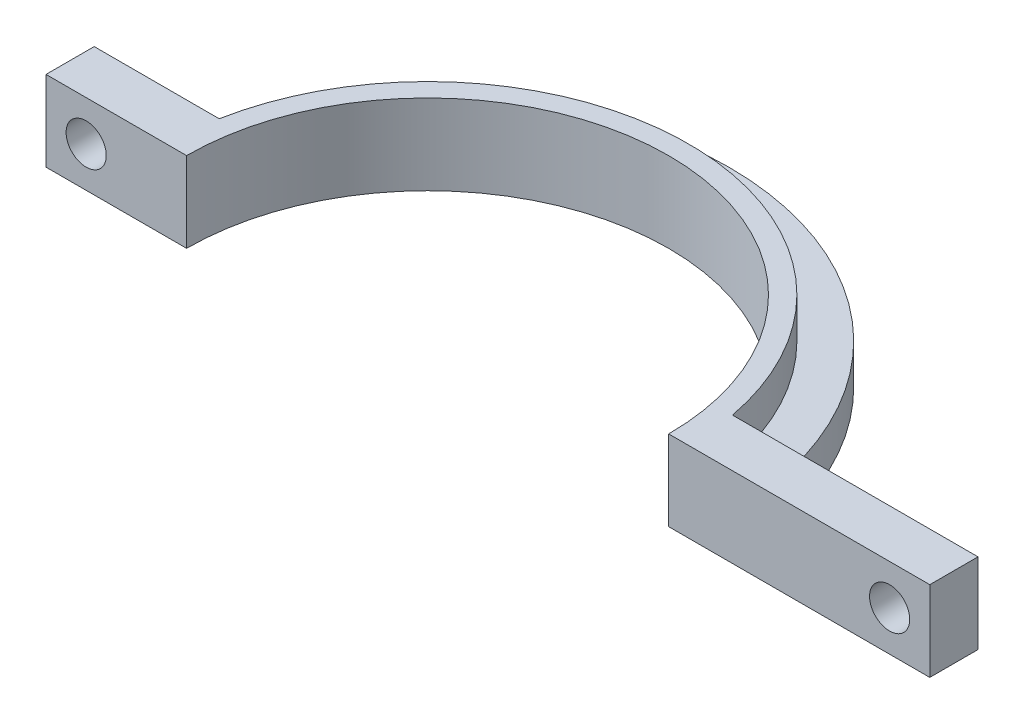
ISO-10303-21;
HEADER;
FILE_DESCRIPTION(('STEP AP214'),'2;1');
FILE_NAME('part.step','',(''),(''),'','','');
FILE_SCHEMA(('AUTOMOTIVE_DESIGN { 1 0 10303 214 1 1 1 1 }'));
ENDSEC;
DATA;
#1=APPLICATION_CONTEXT('core data for automotive mechanical design processes');
#2=APPLICATION_PROTOCOL_DEFINITION('international standard','automotive_design',2000,#1);
#3=PRODUCT_CONTEXT('',#1,'mechanical');
#4=PRODUCT('Part','Part','',(#3));
#5=PRODUCT_RELATED_PRODUCT_CATEGORY('part','',(#4));
#6=PRODUCT_DEFINITION_FORMATION('','',#4);
#7=PRODUCT_DEFINITION_CONTEXT('part definition',#1,'design');
#8=PRODUCT_DEFINITION('design','',#6,#7);
#9=PRODUCT_DEFINITION_SHAPE('','',#8);
#10=(LENGTH_UNIT() NAMED_UNIT(*) SI_UNIT(.MILLI.,.METRE.));
#11=(NAMED_UNIT(*) PLANE_ANGLE_UNIT() SI_UNIT($,.RADIAN.));
#12=(NAMED_UNIT(*) SI_UNIT($,.STERADIAN.) SOLID_ANGLE_UNIT());
#13=UNCERTAINTY_MEASURE_WITH_UNIT(LENGTH_MEASURE(1.E-05),#10,'distance_accuracy_value','');
#14=(GEOMETRIC_REPRESENTATION_CONTEXT(3) GLOBAL_UNCERTAINTY_ASSIGNED_CONTEXT((#13)) GLOBAL_UNIT_ASSIGNED_CONTEXT((#10,
#11,#12)) REPRESENTATION_CONTEXT('',''));
#15=CARTESIAN_POINT('',(0.,0.,0.));
#16=DIRECTION('',(0.,0.,1.));
#17=DIRECTION('',(1.,0.,0.));
#18=AXIS2_PLACEMENT_3D('',#15,#16,#17);
#19=CARTESIAN_POINT('',(0.,10.,-6.));
#20=DIRECTION('',(0.,0.,1.));
#21=DIRECTION('',(1.,0.,0.));
#22=AXIS2_PLACEMENT_3D('',#19,#20,#21);
#23=PLANE('',#22);
#24=CARTESIAN_POINT('',(57.5,5.,-6.00000000000001));
#25=DIRECTION('',(0.,0.,1.));
#26=DIRECTION('',(1.,0.,0.));
#27=AXIS2_PLACEMENT_3D('',#24,#25,#26);
#28=CIRCLE('',#27,2.50000000000001);
#29=CARTESIAN_POINT('',(60.,5.,-6.00000000000001));
#30=VERTEX_POINT('',#29);
#31=EDGE_CURVE('E51',#30,#30,#28,.T.);
#32=ORIENTED_EDGE('',*,*,#31,.T.);
#33=EDGE_LOOP('',(#32));
#34=FACE_BOUND('',#33,.T.);
#35=DIRECTION('',(0.,-1.,0.));
#36=VECTOR('',#35,1.);
#37=CARTESIAN_POINT('',(37.0168880377592,5.,-6.00000000000001));
#38=LINE('',#37,#36);
#39=CARTESIAN_POINT('',(37.0168880377592,5.,-6.00000000000001));
#40=VERTEX_POINT('',#39);
#41=CARTESIAN_POINT('',(37.0168880377592,0.,-6.00000000000001));
#42=VERTEX_POINT('',#41);
#43=EDGE_CURVE('E64',#40,#42,#38,.T.);
#44=ORIENTED_EDGE('',*,*,#43,.F.);
#45=DIRECTION('',(-1.,0.,0.));
#46=VECTOR('',#45,1.);
#47=CARTESIAN_POINT('',(0.,5.,-6.));
#48=LINE('',#47,#46);
#49=CARTESIAN_POINT('',(31.9413525073689,5.,-6.));
#50=VERTEX_POINT('',#49);
#51=EDGE_CURVE('E68',#40,#50,#48,.T.);
#52=ORIENTED_EDGE('',*,*,#51,.T.);
#53=DIRECTION('',(0.,-1.,0.));
#54=VECTOR('',#53,1.);
#55=CARTESIAN_POINT('',(31.9413525073689,10.,-6.));
#56=LINE('',#55,#54);
#57=CARTESIAN_POINT('',(31.9413525073689,10.,-6.));
#58=VERTEX_POINT('',#57);
#59=EDGE_CURVE('E194',#58,#50,#56,.T.);
#60=ORIENTED_EDGE('',*,*,#59,.F.);
#61=DIRECTION('',(-1.,0.,0.));
#62=VECTOR('',#61,1.);
#63=CARTESIAN_POINT('',(0.,10.,-6.));
#64=LINE('',#63,#62);
#65=CARTESIAN_POINT('',(62.5,10.,-6.00000000000001));
#66=VERTEX_POINT('',#65);
#67=EDGE_CURVE('E132',#66,#58,#64,.T.);
#68=ORIENTED_EDGE('',*,*,#67,.F.);
#69=DIRECTION('',(0.,-1.,0.));
#70=VECTOR('',#69,1.);
#71=CARTESIAN_POINT('',(62.5,10.,-6.00000000000001));
#72=LINE('',#71,#70);
#73=CARTESIAN_POINT('',(62.5,0.,-6.00000000000001));
#74=VERTEX_POINT('',#73);
#75=EDGE_CURVE('E57',#66,#74,#72,.T.);
#76=ORIENTED_EDGE('',*,*,#75,.T.);
#77=DIRECTION('',(-1.,0.,0.));
#78=VECTOR('',#77,1.);
#79=CARTESIAN_POINT('',(0.,0.,-6.));
#80=LINE('',#79,#78);
#81=EDGE_CURVE('E158',#74,#42,#80,.T.);
#82=ORIENTED_EDGE('',*,*,#81,.T.);
#83=EDGE_LOOP('',(#44,#52,#60,#68,#76,#82));
#84=FACE_BOUND('',#83,.T.);
#85=ADVANCED_FACE('F47',(#34,#84),#23,.F.);
#86=CARTESIAN_POINT('',(0.,10.,-6.));
#87=DIRECTION('',(0.,0.,-1.));
#88=DIRECTION('',(-1.,0.,0.));
#89=AXIS2_PLACEMENT_3D('',#86,#87,#88);
#90=PLANE('',#89);
#91=CARTESIAN_POINT('',(-42.5,4.99999999999999,-6.));
#92=DIRECTION('',(0.,0.,-1.));
#93=DIRECTION('',(-1.,0.,0.));
#94=AXIS2_PLACEMENT_3D('',#91,#92,#93);
#95=CIRCLE('',#94,2.50000000000001);
#96=CARTESIAN_POINT('',(-45.,4.99999999999999,-6.));
#97=VERTEX_POINT('',#96);
#98=EDGE_CURVE('E262',#97,#97,#95,.T.);
#99=ORIENTED_EDGE('',*,*,#98,.F.);
#100=EDGE_LOOP('',(#99));
#101=FACE_BOUND('',#100,.T.);
#102=DIRECTION('',(1.,0.,0.));
#103=VECTOR('',#102,1.);
#104=CARTESIAN_POINT('',(0.,5.,-6.));
#105=LINE('',#104,#103);
#106=CARTESIAN_POINT('',(-37.0168880377592,5.,-6.));
#107=VERTEX_POINT('',#106);
#108=CARTESIAN_POINT('',(-31.9413525073689,5.,-6.));
#109=VERTEX_POINT('',#108);
#110=EDGE_CURVE('E251',#107,#109,#105,.T.);
#111=ORIENTED_EDGE('',*,*,#110,.F.);
#112=DIRECTION('',(0.,-1.,0.));
#113=VECTOR('',#112,1.);
#114=CARTESIAN_POINT('',(-37.0168880377592,5.,-6.));
#115=LINE('',#114,#113);
#116=CARTESIAN_POINT('',(-37.0168880377592,0.,-6.));
#117=VERTEX_POINT('',#116);
#118=EDGE_CURVE('E232',#107,#117,#115,.T.);
#119=ORIENTED_EDGE('',*,*,#118,.T.);
#120=DIRECTION('',(1.,0.,0.));
#121=VECTOR('',#120,1.);
#122=CARTESIAN_POINT('',(0.,0.,-6.));
#123=LINE('',#122,#121);
#124=CARTESIAN_POINT('',(-47.5,0.,-6.00000000000001));
#125=VERTEX_POINT('',#124);
#126=EDGE_CURVE('E162',#125,#117,#123,.T.);
#127=ORIENTED_EDGE('',*,*,#126,.F.);
#128=DIRECTION('',(0.,-1.,0.));
#129=VECTOR('',#128,1.);
#130=CARTESIAN_POINT('',(-47.5,10.,-6.00000000000001));
#131=LINE('',#130,#129);
#132=CARTESIAN_POINT('',(-47.5,10.,-6.00000000000001));
#133=VERTEX_POINT('',#132);
#134=EDGE_CURVE('E187',#133,#125,#131,.T.);
#135=ORIENTED_EDGE('',*,*,#134,.F.);
#136=DIRECTION('',(1.,0.,0.));
#137=VECTOR('',#136,1.);
#138=CARTESIAN_POINT('',(0.,10.,-6.));
#139=LINE('',#138,#137);
#140=CARTESIAN_POINT('',(-31.9413525073689,10.,-6.));
#141=VERTEX_POINT('',#140);
#142=EDGE_CURVE('E203',#133,#141,#139,.T.);
#143=ORIENTED_EDGE('',*,*,#142,.T.);
#144=DIRECTION('',(0.,-1.,0.));
#145=VECTOR('',#144,1.);
#146=CARTESIAN_POINT('',(-31.9413525073689,10.,-6.));
#147=LINE('',#146,#145);
#148=EDGE_CURVE('E190',#141,#109,#147,.T.);
#149=ORIENTED_EDGE('',*,*,#148,.T.);
#150=EDGE_LOOP('',(#111,#119,#127,#135,#143,#149));
#151=FACE_BOUND('',#150,.T.);
#152=ADVANCED_FACE('F230',(#101,#151),#90,.T.);
#153=CARTESIAN_POINT('',(0.,10.,0.));
#154=DIRECTION('',(0.,0.,-1.));
#155=DIRECTION('',(-1.,0.,0.));
#156=AXIS2_PLACEMENT_3D('',#153,#154,#155);
#157=PLANE('',#156);
#158=CARTESIAN_POINT('',(57.5,5.,0.));
#159=DIRECTION('',(0.,0.,1.));
#160=DIRECTION('',(1.,0.,0.));
#161=AXIS2_PLACEMENT_3D('',#158,#159,#160);
#162=CIRCLE('',#161,2.50000000000001);
#163=CARTESIAN_POINT('',(60.,5.,0.));
#164=VERTEX_POINT('',#163);
#165=EDGE_CURVE('E257',#164,#164,#162,.T.);
#166=ORIENTED_EDGE('',*,*,#165,.F.);
#167=EDGE_LOOP('',(#166));
#168=FACE_BOUND('',#167,.T.);
#169=DIRECTION('',(1.,0.,0.));
#170=VECTOR('',#169,1.);
#171=CARTESIAN_POINT('',(0.,0.,0.));
#172=LINE('',#171,#170);
#173=CARTESIAN_POINT('',(30.,0.,0.));
#174=VERTEX_POINT('',#173);
#175=CARTESIAN_POINT('',(62.5,0.,0.));
#176=VERTEX_POINT('',#175);
#177=EDGE_CURVE('E146',#174,#176,#172,.T.);
#178=ORIENTED_EDGE('',*,*,#177,.T.);
#179=DIRECTION('',(0.,-1.,0.));
#180=VECTOR('',#179,1.);
#181=CARTESIAN_POINT('',(62.5,10.,0.));
#182=LINE('',#181,#180);
#183=CARTESIAN_POINT('',(62.5,10.,0.));
#184=VERTEX_POINT('',#183);
#185=EDGE_CURVE('E11',#184,#176,#182,.T.);
#186=ORIENTED_EDGE('',*,*,#185,.F.);
#187=DIRECTION('',(1.,0.,0.));
#188=VECTOR('',#187,1.);
#189=CARTESIAN_POINT('',(0.,10.,0.));
#190=LINE('',#189,#188);
#191=CARTESIAN_POINT('',(30.,10.,0.));
#192=VERTEX_POINT('',#191);
#193=EDGE_CURVE('E133',#192,#184,#190,.T.);
#194=ORIENTED_EDGE('',*,*,#193,.F.);
#195=DIRECTION('',(0.,-1.,0.));
#196=VECTOR('',#195,1.);
#197=CARTESIAN_POINT('',(30.,10.,0.));
#198=LINE('',#197,#196);
#199=EDGE_CURVE('E148',#192,#174,#198,.T.);
#200=ORIENTED_EDGE('',*,*,#199,.T.);
#201=EDGE_LOOP('',(#178,#186,#194,#200));
#202=FACE_BOUND('',#201,.T.);
#203=ADVANCED_FACE('F49',(#168,#202),#157,.F.);
#204=CARTESIAN_POINT('',(62.5,10.,0.));
#205=DIRECTION('',(-1.,0.,0.));
#206=DIRECTION('',(0.,0.,1.));
#207=AXIS2_PLACEMENT_3D('',#204,#205,#206);
#208=PLANE('',#207);
#209=DIRECTION('',(0.,0.,-1.));
#210=VECTOR('',#209,1.);
#211=CARTESIAN_POINT('',(62.5,0.,0.));
#212=LINE('',#211,#210);
#213=EDGE_CURVE('E153',#176,#74,#212,.T.);
#214=ORIENTED_EDGE('',*,*,#213,.T.);
#215=ORIENTED_EDGE('',*,*,#75,.F.);
#216=DIRECTION('',(0.,0.,-1.));
#217=VECTOR('',#216,1.);
#218=CARTESIAN_POINT('',(62.5,10.,0.));
#219=LINE('',#218,#217);
#220=EDGE_CURVE('E124',#184,#66,#219,.T.);
#221=ORIENTED_EDGE('',*,*,#220,.F.);
#222=ORIENTED_EDGE('',*,*,#185,.T.);
#223=EDGE_LOOP('',(#214,#215,#221,#222));
#224=FACE_BOUND('',#223,.T.);
#225=ADVANCED_FACE('F126',(#224),#208,.F.);
#226=CARTESIAN_POINT('',(0.,10.,0.));
#227=DIRECTION('',(0.,-1.,0.));
#228=DIRECTION('',(0.,0.,-1.));
#229=AXIS2_PLACEMENT_3D('',#226,#227,#228);
#230=CYLINDRICAL_SURFACE('',#229,32.5);
#231=ORIENTED_EDGE('',*,*,#59,.T.);
#232=CARTESIAN_POINT('',(0.,5.,0.));
#233=DIRECTION('',(0.,1.,0.));
#234=DIRECTION('',(0.,0.,1.));
#235=AXIS2_PLACEMENT_3D('',#232,#233,#234);
#236=CIRCLE('',#235,32.5);
#237=EDGE_CURVE('E240',#50,#109,#236,.T.);
#238=ORIENTED_EDGE('',*,*,#237,.T.);
#239=ORIENTED_EDGE('',*,*,#148,.F.);
#240=CARTESIAN_POINT('',(0.,10.,0.));
#241=DIRECTION('',(0.,1.,0.));
#242=DIRECTION('',(0.,0.,1.));
#243=AXIS2_PLACEMENT_3D('',#240,#241,#242);
#244=CIRCLE('',#243,32.5);
#245=EDGE_CURVE('E200',#58,#141,#244,.T.);
#246=ORIENTED_EDGE('',*,*,#245,.F.);
#247=EDGE_LOOP('',(#231,#238,#239,#246));
#248=FACE_BOUND('',#247,.T.);
#249=ADVANCED_FACE('F297',(#248),#230,.T.);
#250=CARTESIAN_POINT('',(-47.5,10.,0.));
#251=DIRECTION('',(1.,0.,0.));
#252=DIRECTION('',(0.,0.,-1.));
#253=AXIS2_PLACEMENT_3D('',#250,#251,#252);
#254=PLANE('',#253);
#255=DIRECTION('',(0.,0.,1.));
#256=VECTOR('',#255,1.);
#257=CARTESIAN_POINT('',(-47.5,0.,0.));
#258=LINE('',#257,#256);
#259=CARTESIAN_POINT('',(-47.5,0.,0.));
#260=VERTEX_POINT('',#259);
#261=EDGE_CURVE('E169',#125,#260,#258,.T.);
#262=ORIENTED_EDGE('',*,*,#261,.T.);
#263=DIRECTION('',(0.,-1.,0.));
#264=VECTOR('',#263,1.);
#265=CARTESIAN_POINT('',(-47.5,10.,0.));
#266=LINE('',#265,#264);
#267=CARTESIAN_POINT('',(-47.5,10.,0.));
#268=VERTEX_POINT('',#267);
#269=EDGE_CURVE('E183',#268,#260,#266,.T.);
#270=ORIENTED_EDGE('',*,*,#269,.F.);
#271=DIRECTION('',(0.,0.,1.));
#272=VECTOR('',#271,1.);
#273=CARTESIAN_POINT('',(-47.5,10.,0.));
#274=LINE('',#273,#272);
#275=EDGE_CURVE('E209',#133,#268,#274,.T.);
#276=ORIENTED_EDGE('',*,*,#275,.F.);
#277=ORIENTED_EDGE('',*,*,#134,.T.);
#278=EDGE_LOOP('',(#262,#270,#276,#277));
#279=FACE_BOUND('',#278,.T.);
#280=ADVANCED_FACE('F227',(#279),#254,.F.);
#281=CARTESIAN_POINT('',(0.,10.,0.));
#282=DIRECTION('',(0.,0.,1.));
#283=DIRECTION('',(1.,0.,0.));
#284=AXIS2_PLACEMENT_3D('',#281,#282,#283);
#285=PLANE('',#284);
#286=ORIENTED_EDGE('',*,*,#269,.T.);
#287=DIRECTION('',(-1.,0.,0.));
#288=VECTOR('',#287,1.);
#289=CARTESIAN_POINT('',(0.,0.,0.));
#290=LINE('',#289,#288);
#291=CARTESIAN_POINT('',(-30.,0.,0.));
#292=VERTEX_POINT('',#291);
#293=EDGE_CURVE('E173',#292,#260,#290,.T.);
#294=ORIENTED_EDGE('',*,*,#293,.F.);
#295=DIRECTION('',(0.,-1.,0.));
#296=VECTOR('',#295,1.);
#297=CARTESIAN_POINT('',(-30.,10.,0.));
#298=LINE('',#297,#296);
#299=CARTESIAN_POINT('',(-30.,10.,0.));
#300=VERTEX_POINT('',#299);
#301=EDGE_CURVE('E180',#300,#292,#298,.T.);
#302=ORIENTED_EDGE('',*,*,#301,.F.);
#303=DIRECTION('',(-1.,0.,0.));
#304=VECTOR('',#303,1.);
#305=CARTESIAN_POINT('',(0.,10.,0.));
#306=LINE('',#305,#304);
#307=EDGE_CURVE('E212',#300,#268,#306,.T.);
#308=ORIENTED_EDGE('',*,*,#307,.T.);
#309=EDGE_LOOP('',(#286,#294,#302,#308));
#310=FACE_BOUND('',#309,.T.);
#311=CARTESIAN_POINT('',(-42.5,4.99999999999999,0.));
#312=DIRECTION('',(0.,0.,1.));
#313=DIRECTION('',(1.,0.,0.));
#314=AXIS2_PLACEMENT_3D('',#311,#312,#313);
#315=CIRCLE('',#314,2.50000000000001);
#316=CARTESIAN_POINT('',(-40.,4.99999999999999,0.));
#317=VERTEX_POINT('',#316);
#318=EDGE_CURVE('E258',#317,#317,#315,.T.);
#319=ORIENTED_EDGE('',*,*,#318,.F.);
#320=EDGE_LOOP('',(#319));
#321=FACE_BOUND('',#320,.T.);
#322=ADVANCED_FACE('F223',(#310,#321),#285,.T.);
#323=CARTESIAN_POINT('',(0.,10.,0.));
#324=DIRECTION('',(0.,-1.,0.));
#325=DIRECTION('',(0.,0.,-1.));
#326=AXIS2_PLACEMENT_3D('',#323,#324,#325);
#327=CYLINDRICAL_SURFACE('',#326,30.);
#328=CARTESIAN_POINT('',(0.,0.,0.));
#329=DIRECTION('',(0.,1.,0.));
#330=DIRECTION('',(0.,0.,1.));
#331=AXIS2_PLACEMENT_3D('',#328,#329,#330);
#332=CIRCLE('',#331,30.);
#333=EDGE_CURVE('E143',#174,#292,#332,.T.);
#334=ORIENTED_EDGE('',*,*,#333,.F.);
#335=ORIENTED_EDGE('',*,*,#199,.F.);
#336=CARTESIAN_POINT('',(0.,10.,0.));
#337=DIRECTION('',(0.,1.,0.));
#338=DIRECTION('',(0.,0.,1.));
#339=AXIS2_PLACEMENT_3D('',#336,#337,#338);
#340=CIRCLE('',#339,30.);
#341=EDGE_CURVE('E140',#192,#300,#340,.T.);
#342=ORIENTED_EDGE('',*,*,#341,.T.);
#343=ORIENTED_EDGE('',*,*,#301,.T.);
#344=EDGE_LOOP('',(#334,#335,#342,#343));
#345=FACE_BOUND('',#344,.T.);
#346=ADVANCED_FACE('F217',(#345),#327,.F.);
#347=CARTESIAN_POINT('',(0.,10.,0.));
#348=DIRECTION('',(0.,1.,0.));
#349=DIRECTION('',(0.,0.,1.));
#350=AXIS2_PLACEMENT_3D('',#347,#348,#349);
#351=PLANE('',#350);
#352=ORIENTED_EDGE('',*,*,#193,.T.);
#353=ORIENTED_EDGE('',*,*,#220,.T.);
#354=ORIENTED_EDGE('',*,*,#67,.T.);
#355=ORIENTED_EDGE('',*,*,#245,.T.);
#356=ORIENTED_EDGE('',*,*,#142,.F.);
#357=ORIENTED_EDGE('',*,*,#275,.T.);
#358=ORIENTED_EDGE('',*,*,#307,.F.);
#359=ORIENTED_EDGE('',*,*,#341,.F.);
#360=EDGE_LOOP('',(#352,#353,#354,#355,#356,#357,#358,#359));
#361=FACE_BOUND('',#360,.T.);
#362=ADVANCED_FACE('F137',(#361),#351,.T.);
#363=CARTESIAN_POINT('',(0.,0.,0.));
#364=DIRECTION('',(0.,1.,0.));
#365=DIRECTION('',(0.,0.,1.));
#366=AXIS2_PLACEMENT_3D('',#363,#364,#365);
#367=PLANE('',#366);
#368=ORIENTED_EDGE('',*,*,#293,.T.);
#369=ORIENTED_EDGE('',*,*,#261,.F.);
#370=ORIENTED_EDGE('',*,*,#126,.T.);
#371=CARTESIAN_POINT('',(0.,0.,0.));
#372=DIRECTION('',(0.,1.,0.));
#373=DIRECTION('',(0.,0.,1.));
#374=AXIS2_PLACEMENT_3D('',#371,#372,#373);
#375=CIRCLE('',#374,37.5);
#376=EDGE_CURVE('E234',#42,#117,#375,.T.);
#377=ORIENTED_EDGE('',*,*,#376,.F.);
#378=ORIENTED_EDGE('',*,*,#81,.F.);
#379=ORIENTED_EDGE('',*,*,#213,.F.);
#380=ORIENTED_EDGE('',*,*,#177,.F.);
#381=ORIENTED_EDGE('',*,*,#333,.T.);
#382=EDGE_LOOP('',(#368,#369,#370,#377,#378,#379,#380,#381));
#383=FACE_BOUND('',#382,.T.);
#384=ADVANCED_FACE('F156',(#383),#367,.F.);
#385=CARTESIAN_POINT('',(-42.5,4.99999999999999,-10.));
#386=DIRECTION('',(0.,0.,1.));
#387=DIRECTION('',(1.,0.,0.));
#388=AXIS2_PLACEMENT_3D('',#385,#386,#387);
#389=CYLINDRICAL_SURFACE('',#388,2.50000000000001);
#390=ORIENTED_EDGE('',*,*,#98,.T.);
#391=EDGE_LOOP('',(#390));
#392=FACE_BOUND('',#391,.T.);
#393=ORIENTED_EDGE('',*,*,#318,.T.);
#394=EDGE_LOOP('',(#393));
#395=FACE_BOUND('',#394,.T.);
#396=ADVANCED_FACE('F278',(#392,#395),#389,.F.);
#397=CARTESIAN_POINT('',(57.5,5.,-10.));
#398=DIRECTION('',(0.,0.,1.));
#399=DIRECTION('',(1.,0.,0.));
#400=AXIS2_PLACEMENT_3D('',#397,#398,#399);
#401=CYLINDRICAL_SURFACE('',#400,2.50000000000001);
#402=ORIENTED_EDGE('',*,*,#165,.T.);
#403=EDGE_LOOP('',(#402));
#404=FACE_BOUND('',#403,.T.);
#405=ORIENTED_EDGE('',*,*,#31,.F.);
#406=EDGE_LOOP('',(#405));
#407=FACE_BOUND('',#406,.T.);
#408=ADVANCED_FACE('F275',(#404,#407),#401,.F.);
#409=CARTESIAN_POINT('',(0.,5.,0.));
#410=DIRECTION('',(0.,1.,0.));
#411=DIRECTION('',(0.,0.,1.));
#412=AXIS2_PLACEMENT_3D('',#409,#410,#411);
#413=PLANE('',#412);
#414=ORIENTED_EDGE('',*,*,#51,.F.);
#415=CARTESIAN_POINT('',(0.,5.,0.));
#416=DIRECTION('',(0.,1.,0.));
#417=DIRECTION('',(0.,0.,1.));
#418=AXIS2_PLACEMENT_3D('',#415,#416,#417);
#419=CIRCLE('',#418,37.5);
#420=EDGE_CURVE('E243',#40,#107,#419,.T.);
#421=ORIENTED_EDGE('',*,*,#420,.T.);
#422=ORIENTED_EDGE('',*,*,#110,.T.);
#423=ORIENTED_EDGE('',*,*,#237,.F.);
#424=EDGE_LOOP('',(#414,#421,#422,#423));
#425=FACE_BOUND('',#424,.T.);
#426=ADVANCED_FACE('F277',(#425),#413,.T.);
#427=CARTESIAN_POINT('',(0.,5.,0.));
#428=DIRECTION('',(0.,-1.,0.));
#429=DIRECTION('',(0.,0.,-1.));
#430=AXIS2_PLACEMENT_3D('',#427,#428,#429);
#431=CYLINDRICAL_SURFACE('',#430,37.5);
#432=ORIENTED_EDGE('',*,*,#420,.F.);
#433=ORIENTED_EDGE('',*,*,#43,.T.);
#434=ORIENTED_EDGE('',*,*,#376,.T.);
#435=ORIENTED_EDGE('',*,*,#118,.F.);
#436=EDGE_LOOP('',(#432,#433,#434,#435));
#437=FACE_BOUND('',#436,.T.);
#438=ADVANCED_FACE('F237',(#437),#431,.T.);
#439=CLOSED_SHELL('',(#85,#152,#203,#225,#249,#280,#322,#346,#362,#384,#396,#408,#426,#438));
#440=MANIFOLD_SOLID_BREP('B2',#439);
#441=ADVANCED_BREP_SHAPE_REPRESENTATION('',(#18,#440),#14);
#442=SHAPE_DEFINITION_REPRESENTATION(#9,#441);
ENDSEC;
END-ISO-10303-21;
